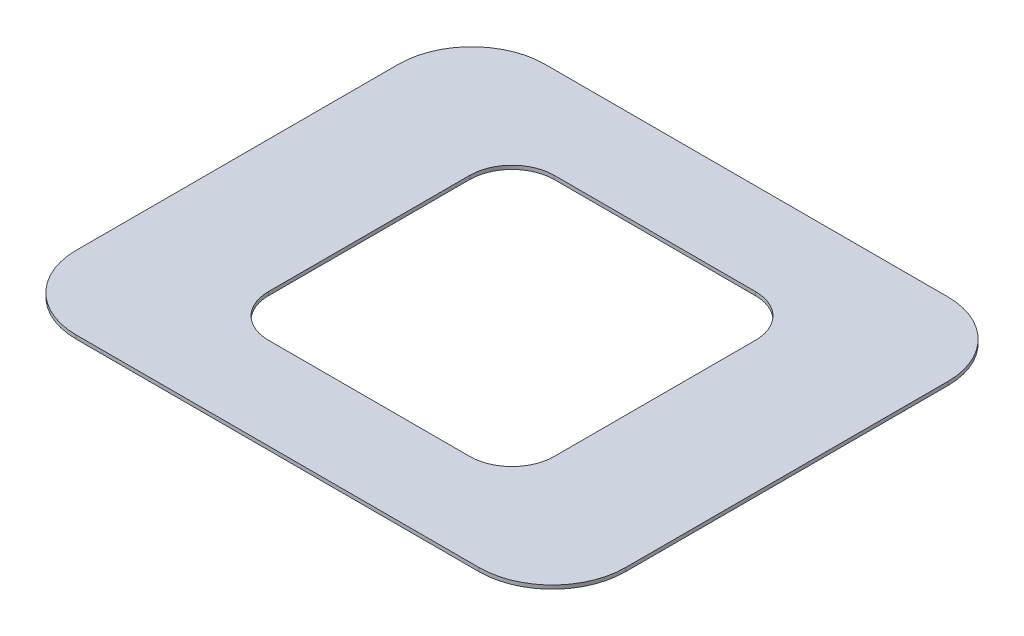
ISO-10303-21;
HEADER;
FILE_DESCRIPTION(('STEP AP214'),'2;1');
FILE_NAME('part.step','',(''),(''),'','','');
FILE_SCHEMA(('AUTOMOTIVE_DESIGN { 1 0 10303 214 1 1 1 1 }'));
ENDSEC;
DATA;
#1=APPLICATION_CONTEXT('core data for automotive mechanical design processes');
#2=APPLICATION_PROTOCOL_DEFINITION('international standard','automotive_design',2000,#1);
#3=PRODUCT_CONTEXT('',#1,'mechanical');
#4=PRODUCT('Part','Part','',(#3));
#5=PRODUCT_RELATED_PRODUCT_CATEGORY('part','',(#4));
#6=PRODUCT_DEFINITION_FORMATION('','',#4);
#7=PRODUCT_DEFINITION_CONTEXT('part definition',#1,'design');
#8=PRODUCT_DEFINITION('design','',#6,#7);
#9=PRODUCT_DEFINITION_SHAPE('','',#8);
#10=(LENGTH_UNIT() NAMED_UNIT(*) SI_UNIT(.MILLI.,.METRE.));
#11=(NAMED_UNIT(*) PLANE_ANGLE_UNIT() SI_UNIT($,.RADIAN.));
#12=(NAMED_UNIT(*) SI_UNIT($,.STERADIAN.) SOLID_ANGLE_UNIT());
#13=UNCERTAINTY_MEASURE_WITH_UNIT(LENGTH_MEASURE(1.E-05),#10,'distance_accuracy_value','');
#14=(GEOMETRIC_REPRESENTATION_CONTEXT(3) GLOBAL_UNCERTAINTY_ASSIGNED_CONTEXT((#13)) GLOBAL_UNIT_ASSIGNED_CONTEXT((#10,
#11,#12)) REPRESENTATION_CONTEXT('',''));
#15=CARTESIAN_POINT('',(0.,0.,0.));
#16=DIRECTION('',(0.,0.,1.));
#17=DIRECTION('',(1.,0.,0.));
#18=AXIS2_PLACEMENT_3D('',#15,#16,#17);
#19=CARTESIAN_POINT('',(127.283018867925,2.,-39.5943396226415));
#20=DIRECTION('',(0.,-1.,0.));
#21=DIRECTION('',(0.,0.,-1.));
#22=AXIS2_PLACEMENT_3D('',#19,#20,#21);
#23=PLANE('',#22);
#24=CARTESIAN_POINT('',(127.283018867925,2.,-39.5943396226415));
#25=DIRECTION('',(0.,1.,0.));
#26=DIRECTION('',(0.,0.,-1.));
#27=AXIS2_PLACEMENT_3D('',#24,#25,#26);
#28=CIRCLE('',#27,40.);
#29=CARTESIAN_POINT('',(167.283018867925,2.,-39.5943396226413));
#30=VERTEX_POINT('',#29);
#31=CARTESIAN_POINT('',(127.283018867924,2.,-79.5943396226415));
#32=VERTEX_POINT('',#31);
#33=EDGE_CURVE('E245',#30,#32,#28,.T.);
#34=ORIENTED_EDGE('',*,*,#33,.T.);
#35=DIRECTION('',(-1.,0.,0.));
#36=VECTOR('',#35,1.);
#37=CARTESIAN_POINT('',(-92.7169811320754,2.,-79.5943396226416));
#38=LINE('',#37,#36);
#39=CARTESIAN_POINT('',(-92.7169811320754,2.,-79.5943396226416));
#40=VERTEX_POINT('',#39);
#41=EDGE_CURVE('E249',#32,#40,#38,.T.);
#42=ORIENTED_EDGE('',*,*,#41,.T.);
#43=CARTESIAN_POINT('',(-92.7169811320754,2.,-39.5943396226415));
#44=DIRECTION('',(0.,1.,0.));
#45=DIRECTION('',(0.,0.,-1.));
#46=AXIS2_PLACEMENT_3D('',#43,#44,#45);
#47=CIRCLE('',#46,40.);
#48=CARTESIAN_POINT('',(-132.716981132075,2.,-39.5943396226415));
#49=VERTEX_POINT('',#48);
#50=EDGE_CURVE('E253',#40,#49,#47,.T.);
#51=ORIENTED_EDGE('',*,*,#50,.T.);
#52=DIRECTION('',(0.,0.,1.));
#53=VECTOR('',#52,1.);
#54=CARTESIAN_POINT('',(-132.716981132075,2.,-39.5943396226415));
#55=LINE('',#54,#53);
#56=CARTESIAN_POINT('',(-132.716981132075,2.,136.405660377358));
#57=VERTEX_POINT('',#56);
#58=EDGE_CURVE('E256',#49,#57,#55,.T.);
#59=ORIENTED_EDGE('',*,*,#58,.T.);
#60=CARTESIAN_POINT('',(-92.7169811320754,2.,136.405660377358));
#61=DIRECTION('',(0.,1.,0.));
#62=DIRECTION('',(0.,0.,1.));
#63=AXIS2_PLACEMENT_3D('',#60,#61,#62);
#64=CIRCLE('',#63,40.);
#65=CARTESIAN_POINT('',(-92.7169811320754,2.,176.405660377358));
#66=VERTEX_POINT('',#65);
#67=EDGE_CURVE('E259',#57,#66,#64,.T.);
#68=ORIENTED_EDGE('',*,*,#67,.T.);
#69=DIRECTION('',(1.,0.,0.));
#70=VECTOR('',#69,1.);
#71=CARTESIAN_POINT('',(-92.7169811320754,2.,176.405660377358));
#72=LINE('',#71,#70);
#73=CARTESIAN_POINT('',(127.283018867925,2.,176.405660377358));
#74=VERTEX_POINT('',#73);
#75=EDGE_CURVE('E262',#66,#74,#72,.T.);
#76=ORIENTED_EDGE('',*,*,#75,.T.);
#77=CARTESIAN_POINT('',(127.283018867925,2.,136.405660377358));
#78=DIRECTION('',(0.,1.,0.));
#79=DIRECTION('',(0.,0.,1.));
#80=AXIS2_PLACEMENT_3D('',#77,#78,#79);
#81=CIRCLE('',#80,40.);
#82=CARTESIAN_POINT('',(167.283018867925,2.,136.405660377358));
#83=VERTEX_POINT('',#82);
#84=EDGE_CURVE('E265',#74,#83,#81,.T.);
#85=ORIENTED_EDGE('',*,*,#84,.T.);
#86=DIRECTION('',(0.,0.,-1.));
#87=VECTOR('',#86,1.);
#88=CARTESIAN_POINT('',(167.283018867925,2.,-39.5943396226413));
#89=LINE('',#88,#87);
#90=EDGE_CURVE('E268',#83,#30,#89,.T.);
#91=ORIENTED_EDGE('',*,*,#90,.T.);
#92=EDGE_LOOP('',(#34,#42,#51,#59,#68,#76,#85,#91));
#93=FACE_BOUND('',#92,.T.);
#94=CARTESIAN_POINT('',(-37.7169811320754,2.,103.405660377358));
#95=DIRECTION('',(0.,1.,0.));
#96=DIRECTION('',(0.,0.,1.));
#97=AXIS2_PLACEMENT_3D('',#94,#95,#96);
#98=CIRCLE('',#97,23.);
#99=CARTESIAN_POINT('',(-60.7169811320754,2.,103.405660377358));
#100=VERTEX_POINT('',#99);
#101=CARTESIAN_POINT('',(-37.7169811320754,2.,126.405660377358));
#102=VERTEX_POINT('',#101);
#103=EDGE_CURVE('E156',#100,#102,#98,.T.);
#104=ORIENTED_EDGE('',*,*,#103,.F.);
#105=DIRECTION('',(0.,0.,1.));
#106=VECTOR('',#105,1.);
#107=CARTESIAN_POINT('',(-60.7169811320754,2.,-6.59433962264154));
#108=LINE('',#107,#106);
#109=CARTESIAN_POINT('',(-60.7169811320754,2.,-6.59433962264154));
#110=VERTEX_POINT('',#109);
#111=EDGE_CURVE('E197',#110,#100,#108,.T.);
#112=ORIENTED_EDGE('',*,*,#111,.F.);
#113=CARTESIAN_POINT('',(-37.7169811320754,2.,-6.59433962264155));
#114=DIRECTION('',(0.,1.,0.));
#115=DIRECTION('',(0.,0.,1.));
#116=AXIS2_PLACEMENT_3D('',#113,#114,#115);
#117=CIRCLE('',#116,23.);
#118=CARTESIAN_POINT('',(-37.7169811320754,2.,-29.5943396226415));
#119=VERTEX_POINT('',#118);
#120=EDGE_CURVE('E194',#119,#110,#117,.T.);
#121=ORIENTED_EDGE('',*,*,#120,.F.);
#122=DIRECTION('',(-1.,0.,0.));
#123=VECTOR('',#122,1.);
#124=CARTESIAN_POINT('',(-37.7169811320754,2.,-29.5943396226415));
#125=LINE('',#124,#123);
#126=CARTESIAN_POINT('',(72.2830188679246,2.,-29.5943396226415));
#127=VERTEX_POINT('',#126);
#128=EDGE_CURVE('E191',#127,#119,#125,.T.);
#129=ORIENTED_EDGE('',*,*,#128,.F.);
#130=CARTESIAN_POINT('',(72.2830188679246,2.,-6.59433962264155));
#131=DIRECTION('',(0.,1.,0.));
#132=DIRECTION('',(0.,0.,-1.));
#133=AXIS2_PLACEMENT_3D('',#130,#131,#132);
#134=CIRCLE('',#133,23.);
#135=CARTESIAN_POINT('',(95.2830188679246,2.,-6.59433962264155));
#136=VERTEX_POINT('',#135);
#137=EDGE_CURVE('E188',#136,#127,#134,.T.);
#138=ORIENTED_EDGE('',*,*,#137,.F.);
#139=DIRECTION('',(0.,0.,-1.));
#140=VECTOR('',#139,1.);
#141=CARTESIAN_POINT('',(95.2830188679246,2.,-6.59433962264155));
#142=LINE('',#141,#140);
#143=CARTESIAN_POINT('',(95.2830188679246,2.,103.405660377358));
#144=VERTEX_POINT('',#143);
#145=EDGE_CURVE('E183',#144,#136,#142,.T.);
#146=ORIENTED_EDGE('',*,*,#145,.F.);
#147=CARTESIAN_POINT('',(72.2830188679246,2.,103.405660377358));
#148=DIRECTION('',(0.,1.,0.));
#149=DIRECTION('',(0.,0.,1.));
#150=AXIS2_PLACEMENT_3D('',#147,#148,#149);
#151=CIRCLE('',#150,23.);
#152=CARTESIAN_POINT('',(72.2830188679246,2.,126.405660377358));
#153=VERTEX_POINT('',#152);
#154=EDGE_CURVE('E179',#153,#144,#151,.T.);
#155=ORIENTED_EDGE('',*,*,#154,.F.);
#156=DIRECTION('',(1.,0.,0.));
#157=VECTOR('',#156,1.);
#158=CARTESIAN_POINT('',(-37.7169811320754,2.,126.405660377358));
#159=LINE('',#158,#157);
#160=EDGE_CURVE('E165',#102,#153,#159,.T.);
#161=ORIENTED_EDGE('',*,*,#160,.F.);
#162=EDGE_LOOP('',(#104,#112,#121,#129,#138,#146,#155,#161));
#163=FACE_BOUND('',#162,.T.);
#164=ADVANCED_FACE('F42',(#93,#163),#23,.F.);
#165=CARTESIAN_POINT('',(127.283018867925,0.,-39.5943396226415));
#166=DIRECTION('',(0.,-1.,0.));
#167=DIRECTION('',(0.,0.,-1.));
#168=AXIS2_PLACEMENT_3D('',#165,#166,#167);
#169=PLANE('',#168);
#170=CARTESIAN_POINT('',(127.283018867925,0.,-39.5943396226415));
#171=DIRECTION('',(0.,1.,0.));
#172=DIRECTION('',(0.,0.,-1.));
#173=AXIS2_PLACEMENT_3D('',#170,#171,#172);
#174=CIRCLE('',#173,40.);
#175=CARTESIAN_POINT('',(167.283018867925,0.,-39.5943396226413));
#176=VERTEX_POINT('',#175);
#177=CARTESIAN_POINT('',(127.283018867924,0.,-79.5943396226415));
#178=VERTEX_POINT('',#177);
#179=EDGE_CURVE('E174',#176,#178,#174,.T.);
#180=ORIENTED_EDGE('',*,*,#179,.F.);
#181=DIRECTION('',(0.,0.,-1.));
#182=VECTOR('',#181,1.);
#183=CARTESIAN_POINT('',(167.283018867925,0.,-39.5943396226413));
#184=LINE('',#183,#182);
#185=CARTESIAN_POINT('',(167.283018867925,0.,136.405660377358));
#186=VERTEX_POINT('',#185);
#187=EDGE_CURVE('E250',#186,#176,#184,.T.);
#188=ORIENTED_EDGE('',*,*,#187,.F.);
#189=CARTESIAN_POINT('',(127.283018867925,0.,136.405660377358));
#190=DIRECTION('',(0.,1.,0.));
#191=DIRECTION('',(0.,0.,1.));
#192=AXIS2_PLACEMENT_3D('',#189,#190,#191);
#193=CIRCLE('',#192,40.);
#194=CARTESIAN_POINT('',(127.283018867925,0.,176.405660377358));
#195=VERTEX_POINT('',#194);
#196=EDGE_CURVE('E290',#195,#186,#193,.T.);
#197=ORIENTED_EDGE('',*,*,#196,.F.);
#198=DIRECTION('',(1.,0.,0.));
#199=VECTOR('',#198,1.);
#200=CARTESIAN_POINT('',(-92.7169811320754,0.,176.405660377358));
#201=LINE('',#200,#199);
#202=CARTESIAN_POINT('',(-92.7169811320754,0.,176.405660377358));
#203=VERTEX_POINT('',#202);
#204=EDGE_CURVE('E287',#203,#195,#201,.T.);
#205=ORIENTED_EDGE('',*,*,#204,.F.);
#206=CARTESIAN_POINT('',(-92.7169811320754,0.,136.405660377358));
#207=DIRECTION('',(0.,1.,0.));
#208=DIRECTION('',(0.,0.,1.));
#209=AXIS2_PLACEMENT_3D('',#206,#207,#208);
#210=CIRCLE('',#209,40.);
#211=CARTESIAN_POINT('',(-132.716981132075,0.,136.405660377358));
#212=VERTEX_POINT('',#211);
#213=EDGE_CURVE('E284',#212,#203,#210,.T.);
#214=ORIENTED_EDGE('',*,*,#213,.F.);
#215=DIRECTION('',(0.,0.,1.));
#216=VECTOR('',#215,1.);
#217=CARTESIAN_POINT('',(-132.716981132075,0.,-39.5943396226415));
#218=LINE('',#217,#216);
#219=CARTESIAN_POINT('',(-132.716981132075,0.,-39.5943396226415));
#220=VERTEX_POINT('',#219);
#221=EDGE_CURVE('E281',#220,#212,#218,.T.);
#222=ORIENTED_EDGE('',*,*,#221,.F.);
#223=CARTESIAN_POINT('',(-92.7169811320754,0.,-39.5943396226415));
#224=DIRECTION('',(0.,1.,0.));
#225=DIRECTION('',(0.,0.,-1.));
#226=AXIS2_PLACEMENT_3D('',#223,#224,#225);
#227=CIRCLE('',#226,40.);
#228=CARTESIAN_POINT('',(-92.7169811320754,0.,-79.5943396226416));
#229=VERTEX_POINT('',#228);
#230=EDGE_CURVE('E278',#229,#220,#227,.T.);
#231=ORIENTED_EDGE('',*,*,#230,.F.);
#232=DIRECTION('',(-1.,0.,0.));
#233=VECTOR('',#232,1.);
#234=CARTESIAN_POINT('',(-92.7169811320754,0.,-79.5943396226416));
#235=LINE('',#234,#233);
#236=EDGE_CURVE('E275',#178,#229,#235,.T.);
#237=ORIENTED_EDGE('',*,*,#236,.F.);
#238=EDGE_LOOP('',(#180,#188,#197,#205,#214,#222,#231,#237));
#239=FACE_BOUND('',#238,.T.);
#240=DIRECTION('',(0.,0.,1.));
#241=VECTOR('',#240,1.);
#242=CARTESIAN_POINT('',(-60.7169811320754,0.,-6.59433962264154));
#243=LINE('',#242,#241);
#244=CARTESIAN_POINT('',(-60.7169811320754,0.,-6.59433962264154));
#245=VERTEX_POINT('',#244);
#246=CARTESIAN_POINT('',(-60.7169811320754,0.,103.405660377358));
#247=VERTEX_POINT('',#246);
#248=EDGE_CURVE('E166',#245,#247,#243,.T.);
#249=ORIENTED_EDGE('',*,*,#248,.T.);
#250=CARTESIAN_POINT('',(-37.7169811320754,0.,103.405660377358));
#251=DIRECTION('',(0.,1.,0.));
#252=DIRECTION('',(0.,0.,1.));
#253=AXIS2_PLACEMENT_3D('',#250,#251,#252);
#254=CIRCLE('',#253,23.);
#255=CARTESIAN_POINT('',(-37.7169811320754,0.,126.405660377358));
#256=VERTEX_POINT('',#255);
#257=EDGE_CURVE('E66',#247,#256,#254,.T.);
#258=ORIENTED_EDGE('',*,*,#257,.T.);
#259=DIRECTION('',(1.,0.,0.));
#260=VECTOR('',#259,1.);
#261=CARTESIAN_POINT('',(-37.7169811320754,0.,126.405660377358));
#262=LINE('',#261,#260);
#263=CARTESIAN_POINT('',(72.2830188679246,0.,126.405660377358));
#264=VERTEX_POINT('',#263);
#265=EDGE_CURVE('E172',#256,#264,#262,.T.);
#266=ORIENTED_EDGE('',*,*,#265,.T.);
#267=CARTESIAN_POINT('',(72.2830188679246,0.,103.405660377358));
#268=DIRECTION('',(0.,1.,0.));
#269=DIRECTION('',(0.,0.,1.));
#270=AXIS2_PLACEMENT_3D('',#267,#268,#269);
#271=CIRCLE('',#270,23.);
#272=CARTESIAN_POINT('',(95.2830188679246,0.,103.405660377358));
#273=VERTEX_POINT('',#272);
#274=EDGE_CURVE('E204',#264,#273,#271,.T.);
#275=ORIENTED_EDGE('',*,*,#274,.T.);
#276=DIRECTION('',(0.,0.,-1.));
#277=VECTOR('',#276,1.);
#278=CARTESIAN_POINT('',(95.2830188679246,0.,-6.59433962264155));
#279=LINE('',#278,#277);
#280=CARTESIAN_POINT('',(95.2830188679246,0.,-6.59433962264155));
#281=VERTEX_POINT('',#280);
#282=EDGE_CURVE('E208',#273,#281,#279,.T.);
#283=ORIENTED_EDGE('',*,*,#282,.T.);
#284=CARTESIAN_POINT('',(72.2830188679246,0.,-6.59433962264155));
#285=DIRECTION('',(0.,1.,0.));
#286=DIRECTION('',(0.,0.,-1.));
#287=AXIS2_PLACEMENT_3D('',#284,#285,#286);
#288=CIRCLE('',#287,23.);
#289=CARTESIAN_POINT('',(72.2830188679246,0.,-29.5943396226415));
#290=VERTEX_POINT('',#289);
#291=EDGE_CURVE('E212',#281,#290,#288,.T.);
#292=ORIENTED_EDGE('',*,*,#291,.T.);
#293=DIRECTION('',(-1.,0.,0.));
#294=VECTOR('',#293,1.);
#295=CARTESIAN_POINT('',(-37.7169811320754,0.,-29.5943396226415));
#296=LINE('',#295,#294);
#297=CARTESIAN_POINT('',(-37.7169811320754,0.,-29.5943396226415));
#298=VERTEX_POINT('',#297);
#299=EDGE_CURVE('E216',#290,#298,#296,.T.);
#300=ORIENTED_EDGE('',*,*,#299,.T.);
#301=CARTESIAN_POINT('',(-37.7169811320754,0.,-6.59433962264155));
#302=DIRECTION('',(0.,1.,0.));
#303=DIRECTION('',(0.,0.,1.));
#304=AXIS2_PLACEMENT_3D('',#301,#302,#303);
#305=CIRCLE('',#304,23.);
#306=EDGE_CURVE('E220',#298,#245,#305,.T.);
#307=ORIENTED_EDGE('',*,*,#306,.T.);
#308=EDGE_LOOP('',(#249,#258,#266,#275,#283,#292,#300,#307));
#309=FACE_BOUND('',#308,.T.);
#310=ADVANCED_FACE('F329',(#239,#309),#169,.T.);
#311=CARTESIAN_POINT('',(127.283018867925,2.,-39.5943396226415));
#312=DIRECTION('',(0.,-1.,0.));
#313=DIRECTION('',(0.,0.,-1.));
#314=AXIS2_PLACEMENT_3D('',#311,#312,#313);
#315=CYLINDRICAL_SURFACE('',#314,40.);
#316=ORIENTED_EDGE('',*,*,#179,.T.);
#317=DIRECTION('',(0.,-1.,0.));
#318=VECTOR('',#317,1.);
#319=CARTESIAN_POINT('',(127.283018867924,2.,-79.5943396226415));
#320=LINE('',#319,#318);
#321=EDGE_CURVE('E11',#32,#178,#320,.T.);
#322=ORIENTED_EDGE('',*,*,#321,.F.);
#323=ORIENTED_EDGE('',*,*,#33,.F.);
#324=DIRECTION('',(0.,-1.,0.));
#325=VECTOR('',#324,1.);
#326=CARTESIAN_POINT('',(167.283018867925,2.,-39.5943396226413));
#327=LINE('',#326,#325);
#328=EDGE_CURVE('E271',#30,#176,#327,.T.);
#329=ORIENTED_EDGE('',*,*,#328,.T.);
#330=EDGE_LOOP('',(#316,#322,#323,#329));
#331=FACE_BOUND('',#330,.T.);
#332=ADVANCED_FACE('F44',(#331),#315,.T.);
#333=CARTESIAN_POINT('',(-92.7169811320754,2.,-79.5943396226416));
#334=DIRECTION('',(0.,0.,1.));
#335=DIRECTION('',(1.,0.,0.));
#336=AXIS2_PLACEMENT_3D('',#333,#334,#335);
#337=PLANE('',#336);
#338=ORIENTED_EDGE('',*,*,#236,.T.);
#339=DIRECTION('',(0.,-1.,0.));
#340=VECTOR('',#339,1.);
#341=CARTESIAN_POINT('',(-92.7169811320754,2.,-79.5943396226416));
#342=LINE('',#341,#340);
#343=EDGE_CURVE('E51',#40,#229,#342,.T.);
#344=ORIENTED_EDGE('',*,*,#343,.F.);
#345=ORIENTED_EDGE('',*,*,#41,.F.);
#346=ORIENTED_EDGE('',*,*,#321,.T.);
#347=EDGE_LOOP('',(#338,#344,#345,#346));
#348=FACE_BOUND('',#347,.T.);
#349=ADVANCED_FACE('F346',(#348),#337,.F.);
#350=CARTESIAN_POINT('',(-92.7169811320754,2.,-39.5943396226415));
#351=DIRECTION('',(0.,-1.,0.));
#352=DIRECTION('',(0.,0.,-1.));
#353=AXIS2_PLACEMENT_3D('',#350,#351,#352);
#354=CYLINDRICAL_SURFACE('',#353,40.);
#355=ORIENTED_EDGE('',*,*,#230,.T.);
#356=DIRECTION('',(0.,-1.,0.));
#357=VECTOR('',#356,1.);
#358=CARTESIAN_POINT('',(-132.716981132075,2.,-39.5943396226415));
#359=LINE('',#358,#357);
#360=EDGE_CURVE('E314',#49,#220,#359,.T.);
#361=ORIENTED_EDGE('',*,*,#360,.F.);
#362=ORIENTED_EDGE('',*,*,#50,.F.);
#363=ORIENTED_EDGE('',*,*,#343,.T.);
#364=EDGE_LOOP('',(#355,#361,#362,#363));
#365=FACE_BOUND('',#364,.T.);
#366=ADVANCED_FACE('F323',(#365),#354,.T.);
#367=CARTESIAN_POINT('',(-132.716981132075,2.,-39.5943396226415));
#368=DIRECTION('',(1.,0.,0.));
#369=DIRECTION('',(0.,0.,-1.));
#370=AXIS2_PLACEMENT_3D('',#367,#368,#369);
#371=PLANE('',#370);
#372=ORIENTED_EDGE('',*,*,#221,.T.);
#373=DIRECTION('',(0.,-1.,0.));
#374=VECTOR('',#373,1.);
#375=CARTESIAN_POINT('',(-132.716981132075,2.,136.405660377358));
#376=LINE('',#375,#374);
#377=EDGE_CURVE('E310',#57,#212,#376,.T.);
#378=ORIENTED_EDGE('',*,*,#377,.F.);
#379=ORIENTED_EDGE('',*,*,#58,.F.);
#380=ORIENTED_EDGE('',*,*,#360,.T.);
#381=EDGE_LOOP('',(#372,#378,#379,#380));
#382=FACE_BOUND('',#381,.T.);
#383=ADVANCED_FACE('F335',(#382),#371,.F.);
#384=CARTESIAN_POINT('',(-92.7169811320754,2.,136.405660377358));
#385=DIRECTION('',(0.,-1.,0.));
#386=DIRECTION('',(0.,0.,-1.));
#387=AXIS2_PLACEMENT_3D('',#384,#385,#386);
#388=CYLINDRICAL_SURFACE('',#387,40.);
#389=ORIENTED_EDGE('',*,*,#213,.T.);
#390=DIRECTION('',(0.,-1.,0.));
#391=VECTOR('',#390,1.);
#392=CARTESIAN_POINT('',(-92.7169811320754,2.,176.405660377358));
#393=LINE('',#392,#391);
#394=EDGE_CURVE('E306',#66,#203,#393,.T.);
#395=ORIENTED_EDGE('',*,*,#394,.F.);
#396=ORIENTED_EDGE('',*,*,#67,.F.);
#397=ORIENTED_EDGE('',*,*,#377,.T.);
#398=EDGE_LOOP('',(#389,#395,#396,#397));
#399=FACE_BOUND('',#398,.T.);
#400=ADVANCED_FACE('F339',(#399),#388,.T.);
#401=CARTESIAN_POINT('',(-92.7169811320754,2.,176.405660377358));
#402=DIRECTION('',(0.,0.,-1.));
#403=DIRECTION('',(-1.,0.,0.));
#404=AXIS2_PLACEMENT_3D('',#401,#402,#403);
#405=PLANE('',#404);
#406=ORIENTED_EDGE('',*,*,#204,.T.);
#407=DIRECTION('',(0.,-1.,0.));
#408=VECTOR('',#407,1.);
#409=CARTESIAN_POINT('',(127.283018867925,2.,176.405660377358));
#410=LINE('',#409,#408);
#411=EDGE_CURVE('E302',#74,#195,#410,.T.);
#412=ORIENTED_EDGE('',*,*,#411,.F.);
#413=ORIENTED_EDGE('',*,*,#75,.F.);
#414=ORIENTED_EDGE('',*,*,#394,.T.);
#415=EDGE_LOOP('',(#406,#412,#413,#414));
#416=FACE_BOUND('',#415,.T.);
#417=ADVANCED_FACE('F359',(#416),#405,.F.);
#418=CARTESIAN_POINT('',(127.283018867925,2.,136.405660377358));
#419=DIRECTION('',(0.,-1.,0.));
#420=DIRECTION('',(0.,0.,-1.));
#421=AXIS2_PLACEMENT_3D('',#418,#419,#420);
#422=CYLINDRICAL_SURFACE('',#421,40.);
#423=ORIENTED_EDGE('',*,*,#196,.T.);
#424=DIRECTION('',(0.,-1.,0.));
#425=VECTOR('',#424,1.);
#426=CARTESIAN_POINT('',(167.283018867925,2.,136.405660377358));
#427=LINE('',#426,#425);
#428=EDGE_CURVE('E298',#83,#186,#427,.T.);
#429=ORIENTED_EDGE('',*,*,#428,.F.);
#430=ORIENTED_EDGE('',*,*,#84,.F.);
#431=ORIENTED_EDGE('',*,*,#411,.T.);
#432=EDGE_LOOP('',(#423,#429,#430,#431));
#433=FACE_BOUND('',#432,.T.);
#434=ADVANCED_FACE('F357',(#433),#422,.T.);
#435=CARTESIAN_POINT('',(167.283018867925,2.,-39.5943396226413));
#436=DIRECTION('',(-1.,0.,0.));
#437=DIRECTION('',(0.,0.,1.));
#438=AXIS2_PLACEMENT_3D('',#435,#436,#437);
#439=PLANE('',#438);
#440=ORIENTED_EDGE('',*,*,#187,.T.);
#441=ORIENTED_EDGE('',*,*,#328,.F.);
#442=ORIENTED_EDGE('',*,*,#90,.F.);
#443=ORIENTED_EDGE('',*,*,#428,.T.);
#444=EDGE_LOOP('',(#440,#441,#442,#443));
#445=FACE_BOUND('',#444,.T.);
#446=ADVANCED_FACE('F352',(#445),#439,.F.);
#447=CARTESIAN_POINT('',(-37.7169811320754,2.,103.405660377358));
#448=DIRECTION('',(0.,-1.,0.));
#449=DIRECTION('',(0.,0.,-1.));
#450=AXIS2_PLACEMENT_3D('',#447,#448,#449);
#451=CYLINDRICAL_SURFACE('',#450,23.);
#452=ORIENTED_EDGE('',*,*,#257,.F.);
#453=DIRECTION('',(0.,-1.,0.));
#454=VECTOR('',#453,1.);
#455=CARTESIAN_POINT('',(-60.7169811320754,2.,103.405660377358));
#456=LINE('',#455,#454);
#457=EDGE_CURVE('E160',#100,#247,#456,.T.);
#458=ORIENTED_EDGE('',*,*,#457,.F.);
#459=ORIENTED_EDGE('',*,*,#103,.T.);
#460=DIRECTION('',(0.,-1.,0.));
#461=VECTOR('',#460,1.);
#462=CARTESIAN_POINT('',(-37.7169811320754,2.,126.405660377358));
#463=LINE('',#462,#461);
#464=EDGE_CURVE('E159',#102,#256,#463,.T.);
#465=ORIENTED_EDGE('',*,*,#464,.T.);
#466=EDGE_LOOP('',(#452,#458,#459,#465));
#467=FACE_BOUND('',#466,.T.);
#468=ADVANCED_FACE('F158',(#467),#451,.F.);
#469=CARTESIAN_POINT('',(-37.7169811320754,2.,126.405660377358));
#470=DIRECTION('',(0.,0.,-1.));
#471=DIRECTION('',(-1.,0.,0.));
#472=AXIS2_PLACEMENT_3D('',#469,#470,#471);
#473=PLANE('',#472);
#474=ORIENTED_EDGE('',*,*,#265,.F.);
#475=ORIENTED_EDGE('',*,*,#464,.F.);
#476=ORIENTED_EDGE('',*,*,#160,.T.);
#477=DIRECTION('',(0.,-1.,0.));
#478=VECTOR('',#477,1.);
#479=CARTESIAN_POINT('',(72.2830188679246,2.,126.405660377358));
#480=LINE('',#479,#478);
#481=EDGE_CURVE('E175',#153,#264,#480,.T.);
#482=ORIENTED_EDGE('',*,*,#481,.T.);
#483=EDGE_LOOP('',(#474,#475,#476,#482));
#484=FACE_BOUND('',#483,.T.);
#485=ADVANCED_FACE('F169',(#484),#473,.T.);
#486=CARTESIAN_POINT('',(72.2830188679246,2.,103.405660377358));
#487=DIRECTION('',(0.,-1.,0.));
#488=DIRECTION('',(0.,0.,-1.));
#489=AXIS2_PLACEMENT_3D('',#486,#487,#488);
#490=CYLINDRICAL_SURFACE('',#489,23.);
#491=ORIENTED_EDGE('',*,*,#274,.F.);
#492=ORIENTED_EDGE('',*,*,#481,.F.);
#493=ORIENTED_EDGE('',*,*,#154,.T.);
#494=DIRECTION('',(0.,-1.,0.));
#495=VECTOR('',#494,1.);
#496=CARTESIAN_POINT('',(95.2830188679246,2.,103.405660377358));
#497=LINE('',#496,#495);
#498=EDGE_CURVE('E240',#144,#273,#497,.T.);
#499=ORIENTED_EDGE('',*,*,#498,.T.);
#500=EDGE_LOOP('',(#491,#492,#493,#499));
#501=FACE_BOUND('',#500,.T.);
#502=ADVANCED_FACE('F384',(#501),#490,.F.);
#503=CARTESIAN_POINT('',(95.2830188679246,2.,-6.59433962264155));
#504=DIRECTION('',(-1.,0.,0.));
#505=DIRECTION('',(0.,0.,1.));
#506=AXIS2_PLACEMENT_3D('',#503,#504,#505);
#507=PLANE('',#506);
#508=ORIENTED_EDGE('',*,*,#282,.F.);
#509=ORIENTED_EDGE('',*,*,#498,.F.);
#510=ORIENTED_EDGE('',*,*,#145,.T.);
#511=DIRECTION('',(0.,-1.,0.));
#512=VECTOR('',#511,1.);
#513=CARTESIAN_POINT('',(95.2830188679246,2.,-6.59433962264155));
#514=LINE('',#513,#512);
#515=EDGE_CURVE('E237',#136,#281,#514,.T.);
#516=ORIENTED_EDGE('',*,*,#515,.T.);
#517=EDGE_LOOP('',(#508,#509,#510,#516));
#518=FACE_BOUND('',#517,.T.);
#519=ADVANCED_FACE('F388',(#518),#507,.T.);
#520=CARTESIAN_POINT('',(72.2830188679246,2.,-6.59433962264155));
#521=DIRECTION('',(0.,-1.,0.));
#522=DIRECTION('',(0.,0.,-1.));
#523=AXIS2_PLACEMENT_3D('',#520,#521,#522);
#524=CYLINDRICAL_SURFACE('',#523,23.);
#525=ORIENTED_EDGE('',*,*,#291,.F.);
#526=ORIENTED_EDGE('',*,*,#515,.F.);
#527=ORIENTED_EDGE('',*,*,#137,.T.);
#528=DIRECTION('',(0.,-1.,0.));
#529=VECTOR('',#528,1.);
#530=CARTESIAN_POINT('',(72.2830188679246,2.,-29.5943396226415));
#531=LINE('',#530,#529);
#532=EDGE_CURVE('E234',#127,#290,#531,.T.);
#533=ORIENTED_EDGE('',*,*,#532,.T.);
#534=EDGE_LOOP('',(#525,#526,#527,#533));
#535=FACE_BOUND('',#534,.T.);
#536=ADVANCED_FACE('F394',(#535),#524,.F.);
#537=CARTESIAN_POINT('',(-37.7169811320754,2.,-29.5943396226415));
#538=DIRECTION('',(0.,0.,1.));
#539=DIRECTION('',(1.,0.,0.));
#540=AXIS2_PLACEMENT_3D('',#537,#538,#539);
#541=PLANE('',#540);
#542=ORIENTED_EDGE('',*,*,#299,.F.);
#543=ORIENTED_EDGE('',*,*,#532,.F.);
#544=ORIENTED_EDGE('',*,*,#128,.T.);
#545=DIRECTION('',(0.,-1.,0.));
#546=VECTOR('',#545,1.);
#547=CARTESIAN_POINT('',(-37.7169811320754,2.,-29.5943396226415));
#548=LINE('',#547,#546);
#549=EDGE_CURVE('E231',#119,#298,#548,.T.);
#550=ORIENTED_EDGE('',*,*,#549,.T.);
#551=EDGE_LOOP('',(#542,#543,#544,#550));
#552=FACE_BOUND('',#551,.T.);
#553=ADVANCED_FACE('F398',(#552),#541,.T.);
#554=CARTESIAN_POINT('',(-37.7169811320754,2.,-6.59433962264155));
#555=DIRECTION('',(0.,-1.,0.));
#556=DIRECTION('',(0.,0.,-1.));
#557=AXIS2_PLACEMENT_3D('',#554,#555,#556);
#558=CYLINDRICAL_SURFACE('',#557,23.);
#559=ORIENTED_EDGE('',*,*,#306,.F.);
#560=ORIENTED_EDGE('',*,*,#549,.F.);
#561=ORIENTED_EDGE('',*,*,#120,.T.);
#562=DIRECTION('',(0.,-1.,0.));
#563=VECTOR('',#562,1.);
#564=CARTESIAN_POINT('',(-60.7169811320754,2.,-6.59433962264154));
#565=LINE('',#564,#563);
#566=EDGE_CURVE('E58',#110,#245,#565,.T.);
#567=ORIENTED_EDGE('',*,*,#566,.T.);
#568=EDGE_LOOP('',(#559,#560,#561,#567));
#569=FACE_BOUND('',#568,.T.);
#570=ADVANCED_FACE('F402',(#569),#558,.F.);
#571=CARTESIAN_POINT('',(-60.7169811320754,2.,-6.59433962264154));
#572=DIRECTION('',(1.,0.,0.));
#573=DIRECTION('',(0.,0.,-1.));
#574=AXIS2_PLACEMENT_3D('',#571,#572,#573);
#575=PLANE('',#574);
#576=ORIENTED_EDGE('',*,*,#248,.F.);
#577=ORIENTED_EDGE('',*,*,#566,.F.);
#578=ORIENTED_EDGE('',*,*,#111,.T.);
#579=ORIENTED_EDGE('',*,*,#457,.T.);
#580=EDGE_LOOP('',(#576,#577,#578,#579));
#581=FACE_BOUND('',#580,.T.);
#582=ADVANCED_FACE('F406',(#581),#575,.T.);
#583=CLOSED_SHELL('',(#164,#310,#332,#349,#366,#383,#400,#417,#434,#446,#468,#485,#502,#519,
#536,#553,#570,#582));
#584=MANIFOLD_SOLID_BREP('B2',#583);
#585=ADVANCED_BREP_SHAPE_REPRESENTATION('',(#18,#584),#14);
#586=SHAPE_DEFINITION_REPRESENTATION(#9,#585);
ENDSEC;
END-ISO-10303-21;
